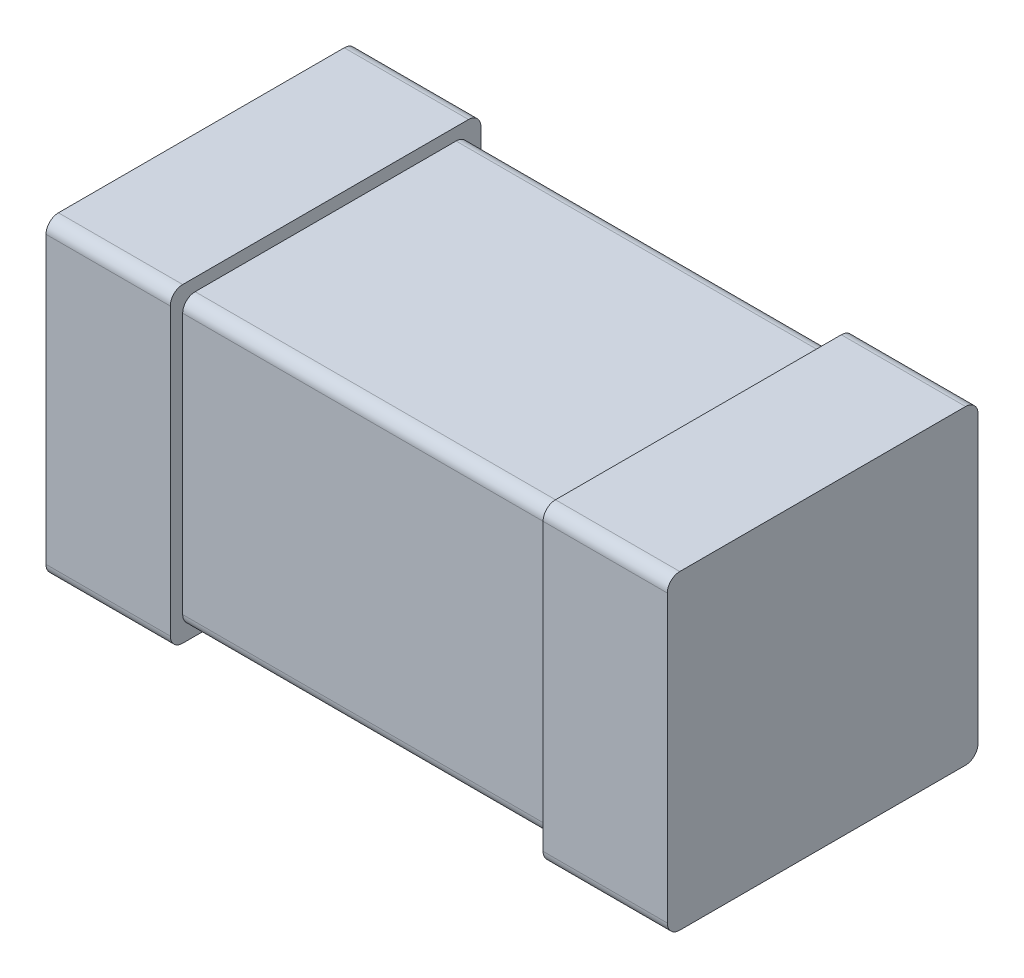
ISO-10303-21;
HEADER;
FILE_DESCRIPTION(('STEP AP214'),'2;1');
FILE_NAME('part.step','',(''),(''),'','','');
FILE_SCHEMA(('AUTOMOTIVE_DESIGN { 1 0 10303 214 1 1 1 1 }'));
ENDSEC;
DATA;
#1=APPLICATION_CONTEXT('core data for automotive mechanical design processes');
#2=APPLICATION_PROTOCOL_DEFINITION('international standard','automotive_design',2000,#1);
#3=PRODUCT_CONTEXT('',#1,'mechanical');
#4=PRODUCT('Part','Part','',(#3));
#5=PRODUCT_RELATED_PRODUCT_CATEGORY('part','',(#4));
#6=PRODUCT_DEFINITION_FORMATION('','',#4);
#7=PRODUCT_DEFINITION_CONTEXT('part definition',#1,'design');
#8=PRODUCT_DEFINITION('design','',#6,#7);
#9=PRODUCT_DEFINITION_SHAPE('','',#8);
#10=(LENGTH_UNIT() NAMED_UNIT(*) SI_UNIT(.MILLI.,.METRE.));
#11=(NAMED_UNIT(*) PLANE_ANGLE_UNIT() SI_UNIT($,.RADIAN.));
#12=(NAMED_UNIT(*) SI_UNIT($,.STERADIAN.) SOLID_ANGLE_UNIT());
#13=UNCERTAINTY_MEASURE_WITH_UNIT(LENGTH_MEASURE(1.E-05),#10,'distance_accuracy_value','');
#14=(GEOMETRIC_REPRESENTATION_CONTEXT(3) GLOBAL_UNCERTAINTY_ASSIGNED_CONTEXT((#13)) GLOBAL_UNIT_ASSIGNED_CONTEXT((#10,
#11,#12)) REPRESENTATION_CONTEXT('',''));
#15=CARTESIAN_POINT('',(0.,0.,0.));
#16=DIRECTION('',(0.,0.,1.));
#17=DIRECTION('',(1.,0.,0.));
#18=AXIS2_PLACEMENT_3D('',#15,#16,#17);
#19=CARTESIAN_POINT('',(-0.5,-0.25,0.));
#20=DIRECTION('',(1.,0.,0.));
#21=DIRECTION('',(0.,0.,-1.));
#22=AXIS2_PLACEMENT_3D('',#19,#20,#21);
#23=PLANE('',#22);
#24=DIRECTION('',(0.,1.,0.));
#25=VECTOR('',#24,1.);
#26=CARTESIAN_POINT('',(-0.5,-0.25,0.5));
#27=LINE('',#26,#25);
#28=CARTESIAN_POINT('',(-0.5,0.23,0.5));
#29=VERTEX_POINT('',#28);
#30=CARTESIAN_POINT('',(-0.5,-0.23,0.5));
#31=VERTEX_POINT('',#30);
#32=EDGE_CURVE('E300',#29,#31,#27,.F.);
#33=ORIENTED_EDGE('',*,*,#32,.F.);
#34=CARTESIAN_POINT('',(-0.5,0.23,0.48));
#35=DIRECTION('',(1.,0.,0.));
#36=DIRECTION('',(0.,0.,-1.));
#37=AXIS2_PLACEMENT_3D('',#34,#35,#36);
#38=CIRCLE('',#37,0.02);
#39=CARTESIAN_POINT('',(-0.5,0.25,0.48));
#40=VERTEX_POINT('',#39);
#41=EDGE_CURVE('E279',#40,#29,#38,.T.);
#42=ORIENTED_EDGE('',*,*,#41,.F.);
#43=DIRECTION('',(0.,0.,1.));
#44=VECTOR('',#43,1.);
#45=CARTESIAN_POINT('',(-0.5,0.25,0.));
#46=LINE('',#45,#44);
#47=CARTESIAN_POINT('',(-0.5,0.25,0.02));
#48=VERTEX_POINT('',#47);
#49=EDGE_CURVE('E201',#48,#40,#46,.T.);
#50=ORIENTED_EDGE('',*,*,#49,.F.);
#51=CARTESIAN_POINT('',(-0.5,0.23,0.02));
#52=DIRECTION('',(1.,0.,0.));
#53=DIRECTION('',(0.,0.,-1.));
#54=AXIS2_PLACEMENT_3D('',#51,#52,#53);
#55=CIRCLE('',#54,0.02);
#56=CARTESIAN_POINT('',(-0.5,0.23,0.));
#57=VERTEX_POINT('',#56);
#58=EDGE_CURVE('E196',#57,#48,#55,.T.);
#59=ORIENTED_EDGE('',*,*,#58,.F.);
#60=DIRECTION('',(0.,1.,0.));
#61=VECTOR('',#60,1.);
#62=CARTESIAN_POINT('',(-0.5,-0.25,0.));
#63=LINE('',#62,#61);
#64=CARTESIAN_POINT('',(-0.5,-0.23,0.));
#65=VERTEX_POINT('',#64);
#66=EDGE_CURVE('E188',#57,#65,#63,.F.);
#67=ORIENTED_EDGE('',*,*,#66,.T.);
#68=CARTESIAN_POINT('',(-0.5,-0.23,0.02));
#69=DIRECTION('',(1.,0.,0.));
#70=DIRECTION('',(0.,0.,-1.));
#71=AXIS2_PLACEMENT_3D('',#68,#69,#70);
#72=CIRCLE('',#71,0.02);
#73=CARTESIAN_POINT('',(-0.5,-0.25,0.02));
#74=VERTEX_POINT('',#73);
#75=EDGE_CURVE('E20',#74,#65,#72,.T.);
#76=ORIENTED_EDGE('',*,*,#75,.F.);
#77=DIRECTION('',(0.,0.,1.));
#78=VECTOR('',#77,1.);
#79=CARTESIAN_POINT('',(-0.5,-0.25,0.));
#80=LINE('',#79,#78);
#81=CARTESIAN_POINT('',(-0.5,-0.25,0.48));
#82=VERTEX_POINT('',#81);
#83=EDGE_CURVE('E171',#74,#82,#80,.T.);
#84=ORIENTED_EDGE('',*,*,#83,.T.);
#85=CARTESIAN_POINT('',(-0.5,-0.23,0.48));
#86=DIRECTION('',(1.,0.,0.));
#87=DIRECTION('',(0.,0.,-1.));
#88=AXIS2_PLACEMENT_3D('',#85,#86,#87);
#89=CIRCLE('',#88,0.02);
#90=EDGE_CURVE('E275',#31,#82,#89,.T.);
#91=ORIENTED_EDGE('',*,*,#90,.F.);
#92=EDGE_LOOP('',(#33,#42,#50,#59,#67,#76,#84,#91));
#93=FACE_BOUND('',#92,.T.);
#94=ADVANCED_FACE('F17',(#93),#23,.F.);
#95=CARTESIAN_POINT('',(0.5,-0.25,0.));
#96=DIRECTION('',(1.,0.,0.));
#97=DIRECTION('',(0.,0.,-1.));
#98=AXIS2_PLACEMENT_3D('',#95,#96,#97);
#99=PLANE('',#98);
#100=DIRECTION('',(0.,1.,0.));
#101=VECTOR('',#100,1.);
#102=CARTESIAN_POINT('',(0.5,-0.25,0.5));
#103=LINE('',#102,#101);
#104=CARTESIAN_POINT('',(0.5,-0.23,0.5));
#105=VERTEX_POINT('',#104);
#106=CARTESIAN_POINT('',(0.5,0.23,0.5));
#107=VERTEX_POINT('',#106);
#108=EDGE_CURVE('E290',#105,#107,#103,.T.);
#109=ORIENTED_EDGE('',*,*,#108,.F.);
#110=CARTESIAN_POINT('',(0.5,-0.23,0.48));
#111=DIRECTION('',(1.,0.,0.));
#112=DIRECTION('',(0.,0.,-1.));
#113=AXIS2_PLACEMENT_3D('',#110,#111,#112);
#114=CIRCLE('',#113,0.02);
#115=CARTESIAN_POINT('',(0.5,-0.25,0.48));
#116=VERTEX_POINT('',#115);
#117=EDGE_CURVE('E259',#116,#105,#114,.F.);
#118=ORIENTED_EDGE('',*,*,#117,.F.);
#119=DIRECTION('',(0.,0.,1.));
#120=VECTOR('',#119,1.);
#121=CARTESIAN_POINT('',(0.5,-0.25,0.));
#122=LINE('',#121,#120);
#123=CARTESIAN_POINT('',(0.5,-0.25,0.02));
#124=VERTEX_POINT('',#123);
#125=EDGE_CURVE('E274',#116,#124,#122,.F.);
#126=ORIENTED_EDGE('',*,*,#125,.T.);
#127=CARTESIAN_POINT('',(0.5,-0.23,0.02));
#128=DIRECTION('',(1.,0.,0.));
#129=DIRECTION('',(0.,0.,-1.));
#130=AXIS2_PLACEMENT_3D('',#127,#128,#129);
#131=CIRCLE('',#130,0.02);
#132=CARTESIAN_POINT('',(0.5,-0.23,0.));
#133=VERTEX_POINT('',#132);
#134=EDGE_CURVE('E271',#133,#124,#131,.F.);
#135=ORIENTED_EDGE('',*,*,#134,.F.);
#136=DIRECTION('',(0.,1.,0.));
#137=VECTOR('',#136,1.);
#138=CARTESIAN_POINT('',(0.5,-0.25,0.));
#139=LINE('',#138,#137);
#140=CARTESIAN_POINT('',(0.5,0.23,0.));
#141=VERTEX_POINT('',#140);
#142=EDGE_CURVE('E270',#133,#141,#139,.T.);
#143=ORIENTED_EDGE('',*,*,#142,.T.);
#144=CARTESIAN_POINT('',(0.5,0.23,0.02));
#145=DIRECTION('',(1.,0.,0.));
#146=DIRECTION('',(0.,0.,-1.));
#147=AXIS2_PLACEMENT_3D('',#144,#145,#146);
#148=CIRCLE('',#147,0.02);
#149=CARTESIAN_POINT('',(0.5,0.25,0.02));
#150=VERTEX_POINT('',#149);
#151=EDGE_CURVE('E267',#150,#141,#148,.F.);
#152=ORIENTED_EDGE('',*,*,#151,.F.);
#153=DIRECTION('',(0.,0.,1.));
#154=VECTOR('',#153,1.);
#155=CARTESIAN_POINT('',(0.5,0.25,0.));
#156=LINE('',#155,#154);
#157=CARTESIAN_POINT('',(0.5,0.25,0.48));
#158=VERTEX_POINT('',#157);
#159=EDGE_CURVE('E295',#158,#150,#156,.F.);
#160=ORIENTED_EDGE('',*,*,#159,.F.);
#161=CARTESIAN_POINT('',(0.5,0.23,0.48));
#162=DIRECTION('',(1.,0.,0.));
#163=DIRECTION('',(0.,0.,-1.));
#164=AXIS2_PLACEMENT_3D('',#161,#162,#163);
#165=CIRCLE('',#164,0.02);
#166=EDGE_CURVE('E263',#107,#158,#165,.F.);
#167=ORIENTED_EDGE('',*,*,#166,.F.);
#168=EDGE_LOOP('',(#109,#118,#126,#135,#143,#152,#160,#167));
#169=FACE_BOUND('',#168,.T.);
#170=ADVANCED_FACE('F444',(#169),#99,.T.);
#171=CARTESIAN_POINT('',(-0.5,-0.25,0.));
#172=DIRECTION('',(0.,1.,0.));
#173=DIRECTION('',(0.,0.,1.));
#174=AXIS2_PLACEMENT_3D('',#171,#172,#173);
#175=PLANE('',#174);
#176=ORIENTED_EDGE('',*,*,#83,.F.);
#177=DIRECTION('',(1.,0.,0.));
#178=VECTOR('',#177,1.);
#179=CARTESIAN_POINT('',(-0.5,-0.25,0.02));
#180=LINE('',#179,#178);
#181=CARTESIAN_POINT('',(-0.3,-0.25,0.02));
#182=VERTEX_POINT('',#181);
#183=EDGE_CURVE('E182',#182,#74,#180,.F.);
#184=ORIENTED_EDGE('',*,*,#183,.F.);
#185=DIRECTION('',(0.,0.,-1.));
#186=VECTOR('',#185,1.);
#187=CARTESIAN_POINT('',(-0.3,-0.25,0.));
#188=LINE('',#187,#186);
#189=CARTESIAN_POINT('',(-0.3,-0.25,0.48));
#190=VERTEX_POINT('',#189);
#191=EDGE_CURVE('E258',#190,#182,#188,.T.);
#192=ORIENTED_EDGE('',*,*,#191,.F.);
#193=DIRECTION('',(1.,0.,0.));
#194=VECTOR('',#193,1.);
#195=CARTESIAN_POINT('',(-0.5,-0.25,0.48));
#196=LINE('',#195,#194);
#197=EDGE_CURVE('E307',#82,#190,#196,.T.);
#198=ORIENTED_EDGE('',*,*,#197,.F.);
#199=EDGE_LOOP('',(#176,#184,#192,#198));
#200=FACE_BOUND('',#199,.T.);
#201=ADVANCED_FACE('F310',(#200),#175,.F.);
#202=CARTESIAN_POINT('',(-0.5,-0.23,0.02));
#203=DIRECTION('',(1.,0.,0.));
#204=DIRECTION('',(0.,0.,-1.));
#205=AXIS2_PLACEMENT_3D('',#202,#203,#204);
#206=CYLINDRICAL_SURFACE('',#205,0.02);
#207=CARTESIAN_POINT('',(-0.3,-0.23,0.02));
#208=DIRECTION('',(1.,0.,0.));
#209=DIRECTION('',(0.,0.,-1.));
#210=AXIS2_PLACEMENT_3D('',#207,#208,#209);
#211=CIRCLE('',#210,0.02);
#212=CARTESIAN_POINT('',(-0.3,-0.23,0.));
#213=VERTEX_POINT('',#212);
#214=EDGE_CURVE('E256',#182,#213,#211,.T.);
#215=ORIENTED_EDGE('',*,*,#214,.F.);
#216=ORIENTED_EDGE('',*,*,#183,.T.);
#217=ORIENTED_EDGE('',*,*,#75,.T.);
#218=DIRECTION('',(1.,0.,0.));
#219=VECTOR('',#218,1.);
#220=CARTESIAN_POINT('',(-0.5,-0.23,0.));
#221=LINE('',#220,#219);
#222=EDGE_CURVE('E180',#65,#213,#221,.T.);
#223=ORIENTED_EDGE('',*,*,#222,.T.);
#224=EDGE_LOOP('',(#215,#216,#217,#223));
#225=FACE_BOUND('',#224,.T.);
#226=ADVANCED_FACE('F179',(#225),#206,.T.);
#227=CARTESIAN_POINT('',(-0.5,-0.25,0.));
#228=DIRECTION('',(0.,0.,1.));
#229=DIRECTION('',(1.,0.,0.));
#230=AXIS2_PLACEMENT_3D('',#227,#228,#229);
#231=PLANE('',#230);
#232=DIRECTION('',(0.,1.,0.));
#233=VECTOR('',#232,1.);
#234=CARTESIAN_POINT('',(-0.3,-0.25,0.));
#235=LINE('',#234,#233);
#236=CARTESIAN_POINT('',(-0.3,0.23,0.));
#237=VERTEX_POINT('',#236);
#238=EDGE_CURVE('E190',#213,#237,#235,.T.);
#239=ORIENTED_EDGE('',*,*,#238,.F.);
#240=ORIENTED_EDGE('',*,*,#222,.F.);
#241=ORIENTED_EDGE('',*,*,#66,.F.);
#242=DIRECTION('',(1.,0.,0.));
#243=VECTOR('',#242,1.);
#244=CARTESIAN_POINT('',(-0.5,0.23,0.));
#245=LINE('',#244,#243);
#246=EDGE_CURVE('E191',#237,#57,#245,.F.);
#247=ORIENTED_EDGE('',*,*,#246,.F.);
#248=EDGE_LOOP('',(#239,#240,#241,#247));
#249=FACE_BOUND('',#248,.T.);
#250=ADVANCED_FACE('F186',(#249),#231,.F.);
#251=CARTESIAN_POINT('',(-0.5,0.23,0.02));
#252=DIRECTION('',(1.,0.,0.));
#253=DIRECTION('',(0.,0.,-1.));
#254=AXIS2_PLACEMENT_3D('',#251,#252,#253);
#255=CYLINDRICAL_SURFACE('',#254,0.02);
#256=ORIENTED_EDGE('',*,*,#246,.T.);
#257=ORIENTED_EDGE('',*,*,#58,.T.);
#258=DIRECTION('',(1.,0.,0.));
#259=VECTOR('',#258,1.);
#260=CARTESIAN_POINT('',(-0.5,0.25,0.02));
#261=LINE('',#260,#259);
#262=CARTESIAN_POINT('',(-0.3,0.25,0.02));
#263=VERTEX_POINT('',#262);
#264=EDGE_CURVE('E281',#263,#48,#261,.F.);
#265=ORIENTED_EDGE('',*,*,#264,.F.);
#266=CARTESIAN_POINT('',(-0.3,0.23,0.02));
#267=DIRECTION('',(1.,0.,0.));
#268=DIRECTION('',(0.,0.,-1.));
#269=AXIS2_PLACEMENT_3D('',#266,#267,#268);
#270=CIRCLE('',#269,0.02);
#271=EDGE_CURVE('E254',#237,#263,#270,.T.);
#272=ORIENTED_EDGE('',*,*,#271,.F.);
#273=EDGE_LOOP('',(#256,#257,#265,#272));
#274=FACE_BOUND('',#273,.T.);
#275=ADVANCED_FACE('F674',(#274),#255,.T.);
#276=CARTESIAN_POINT('',(-0.5,0.25,0.));
#277=DIRECTION('',(0.,1.,0.));
#278=DIRECTION('',(0.,0.,1.));
#279=AXIS2_PLACEMENT_3D('',#276,#277,#278);
#280=PLANE('',#279);
#281=ORIENTED_EDGE('',*,*,#49,.T.);
#282=DIRECTION('',(1.,0.,0.));
#283=VECTOR('',#282,1.);
#284=CARTESIAN_POINT('',(-0.5,0.25,0.48));
#285=LINE('',#284,#283);
#286=CARTESIAN_POINT('',(-0.3,0.25,0.48));
#287=VERTEX_POINT('',#286);
#288=EDGE_CURVE('E280',#287,#40,#285,.F.);
#289=ORIENTED_EDGE('',*,*,#288,.F.);
#290=DIRECTION('',(0.,0.,-1.));
#291=VECTOR('',#290,1.);
#292=CARTESIAN_POINT('',(-0.3,0.25,0.));
#293=LINE('',#292,#291);
#294=EDGE_CURVE('E253',#263,#287,#293,.F.);
#295=ORIENTED_EDGE('',*,*,#294,.F.);
#296=ORIENTED_EDGE('',*,*,#264,.T.);
#297=EDGE_LOOP('',(#281,#289,#295,#296));
#298=FACE_BOUND('',#297,.T.);
#299=ADVANCED_FACE('F666',(#298),#280,.T.);
#300=CARTESIAN_POINT('',(-0.5,0.23,0.48));
#301=DIRECTION('',(1.,0.,0.));
#302=DIRECTION('',(0.,0.,-1.));
#303=AXIS2_PLACEMENT_3D('',#300,#301,#302);
#304=CYLINDRICAL_SURFACE('',#303,0.02);
#305=CARTESIAN_POINT('',(-0.3,0.23,0.48));
#306=DIRECTION('',(1.,0.,0.));
#307=DIRECTION('',(0.,0.,-1.));
#308=AXIS2_PLACEMENT_3D('',#305,#306,#307);
#309=CIRCLE('',#308,0.02);
#310=CARTESIAN_POINT('',(-0.3,0.23,0.5));
#311=VERTEX_POINT('',#310);
#312=EDGE_CURVE('E251',#287,#311,#309,.T.);
#313=ORIENTED_EDGE('',*,*,#312,.F.);
#314=ORIENTED_EDGE('',*,*,#288,.T.);
#315=ORIENTED_EDGE('',*,*,#41,.T.);
#316=DIRECTION('',(1.,0.,0.));
#317=VECTOR('',#316,1.);
#318=CARTESIAN_POINT('',(-0.5,0.23,0.5));
#319=LINE('',#318,#317);
#320=EDGE_CURVE('E301',#311,#29,#319,.F.);
#321=ORIENTED_EDGE('',*,*,#320,.F.);
#322=EDGE_LOOP('',(#313,#314,#315,#321));
#323=FACE_BOUND('',#322,.T.);
#324=ADVANCED_FACE('F322',(#323),#304,.T.);
#325=CARTESIAN_POINT('',(-0.5,-0.25,0.5));
#326=DIRECTION('',(0.,0.,1.));
#327=DIRECTION('',(1.,0.,0.));
#328=AXIS2_PLACEMENT_3D('',#325,#326,#327);
#329=PLANE('',#328);
#330=DIRECTION('',(0.,1.,0.));
#331=VECTOR('',#330,1.);
#332=CARTESIAN_POINT('',(-0.3,-0.25,0.5));
#333=LINE('',#332,#331);
#334=CARTESIAN_POINT('',(-0.3,-0.23,0.5));
#335=VERTEX_POINT('',#334);
#336=EDGE_CURVE('E250',#311,#335,#333,.F.);
#337=ORIENTED_EDGE('',*,*,#336,.F.);
#338=ORIENTED_EDGE('',*,*,#320,.T.);
#339=ORIENTED_EDGE('',*,*,#32,.T.);
#340=DIRECTION('',(1.,0.,0.));
#341=VECTOR('',#340,1.);
#342=CARTESIAN_POINT('',(-0.5,-0.23,0.5));
#343=LINE('',#342,#341);
#344=EDGE_CURVE('E278',#335,#31,#343,.F.);
#345=ORIENTED_EDGE('',*,*,#344,.F.);
#346=EDGE_LOOP('',(#337,#338,#339,#345));
#347=FACE_BOUND('',#346,.T.);
#348=ADVANCED_FACE('F328',(#347),#329,.T.);
#349=CARTESIAN_POINT('',(-0.5,-0.23,0.48));
#350=DIRECTION('',(1.,0.,0.));
#351=DIRECTION('',(0.,0.,-1.));
#352=AXIS2_PLACEMENT_3D('',#349,#350,#351);
#353=CYLINDRICAL_SURFACE('',#352,0.02);
#354=ORIENTED_EDGE('',*,*,#344,.T.);
#355=ORIENTED_EDGE('',*,*,#90,.T.);
#356=ORIENTED_EDGE('',*,*,#197,.T.);
#357=CARTESIAN_POINT('',(-0.3,-0.23,0.48));
#358=DIRECTION('',(1.,0.,0.));
#359=DIRECTION('',(0.,0.,-1.));
#360=AXIS2_PLACEMENT_3D('',#357,#358,#359);
#361=CIRCLE('',#360,0.02);
#362=EDGE_CURVE('E247',#335,#190,#361,.T.);
#363=ORIENTED_EDGE('',*,*,#362,.F.);
#364=EDGE_LOOP('',(#354,#355,#356,#363));
#365=FACE_BOUND('',#364,.T.);
#366=ADVANCED_FACE('F305',(#365),#353,.T.);
#367=CARTESIAN_POINT('',(0.3,-0.25,0.));
#368=DIRECTION('',(0.,1.,0.));
#369=DIRECTION('',(0.,0.,1.));
#370=AXIS2_PLACEMENT_3D('',#367,#368,#369);
#371=PLANE('',#370);
#372=DIRECTION('',(0.,0.,-1.));
#373=VECTOR('',#372,1.);
#374=CARTESIAN_POINT('',(0.3,-0.25,0.));
#375=LINE('',#374,#373);
#376=CARTESIAN_POINT('',(0.3,-0.25,0.48));
#377=VERTEX_POINT('',#376);
#378=CARTESIAN_POINT('',(0.3,-0.25,0.02));
#379=VERTEX_POINT('',#378);
#380=EDGE_CURVE('E236',#377,#379,#375,.T.);
#381=ORIENTED_EDGE('',*,*,#380,.T.);
#382=DIRECTION('',(1.,0.,0.));
#383=VECTOR('',#382,1.);
#384=CARTESIAN_POINT('',(0.3,-0.25,0.02));
#385=LINE('',#384,#383);
#386=EDGE_CURVE('E273',#124,#379,#385,.F.);
#387=ORIENTED_EDGE('',*,*,#386,.F.);
#388=ORIENTED_EDGE('',*,*,#125,.F.);
#389=DIRECTION('',(1.,0.,0.));
#390=VECTOR('',#389,1.);
#391=CARTESIAN_POINT('',(0.3,-0.25,0.48));
#392=LINE('',#391,#390);
#393=EDGE_CURVE('E262',#377,#116,#392,.T.);
#394=ORIENTED_EDGE('',*,*,#393,.F.);
#395=EDGE_LOOP('',(#381,#387,#388,#394));
#396=FACE_BOUND('',#395,.T.);
#397=ADVANCED_FACE('F369',(#396),#371,.F.);
#398=CARTESIAN_POINT('',(0.3,-0.23,0.02));
#399=DIRECTION('',(1.,0.,0.));
#400=DIRECTION('',(0.,0.,-1.));
#401=AXIS2_PLACEMENT_3D('',#398,#399,#400);
#402=CYLINDRICAL_SURFACE('',#401,0.02);
#403=ORIENTED_EDGE('',*,*,#134,.T.);
#404=ORIENTED_EDGE('',*,*,#386,.T.);
#405=CARTESIAN_POINT('',(0.3,-0.23,0.02));
#406=DIRECTION('',(1.,0.,0.));
#407=DIRECTION('',(0.,0.,-1.));
#408=AXIS2_PLACEMENT_3D('',#405,#406,#407);
#409=CIRCLE('',#408,0.02);
#410=CARTESIAN_POINT('',(0.3,-0.23,0.));
#411=VERTEX_POINT('',#410);
#412=EDGE_CURVE('E233',#379,#411,#409,.T.);
#413=ORIENTED_EDGE('',*,*,#412,.T.);
#414=DIRECTION('',(1.,0.,0.));
#415=VECTOR('',#414,1.);
#416=CARTESIAN_POINT('',(0.3,-0.23,0.));
#417=LINE('',#416,#415);
#418=EDGE_CURVE('E299',#411,#133,#417,.T.);
#419=ORIENTED_EDGE('',*,*,#418,.T.);
#420=EDGE_LOOP('',(#403,#404,#413,#419));
#421=FACE_BOUND('',#420,.T.);
#422=ADVANCED_FACE('F358',(#421),#402,.T.);
#423=CARTESIAN_POINT('',(0.3,-0.25,0.));
#424=DIRECTION('',(0.,0.,1.));
#425=DIRECTION('',(1.,0.,0.));
#426=AXIS2_PLACEMENT_3D('',#423,#424,#425);
#427=PLANE('',#426);
#428=ORIENTED_EDGE('',*,*,#142,.F.);
#429=ORIENTED_EDGE('',*,*,#418,.F.);
#430=DIRECTION('',(0.,1.,0.));
#431=VECTOR('',#430,1.);
#432=CARTESIAN_POINT('',(0.3,-0.25,0.));
#433=LINE('',#432,#431);
#434=CARTESIAN_POINT('',(0.3,0.23,0.));
#435=VERTEX_POINT('',#434);
#436=EDGE_CURVE('E232',#411,#435,#433,.T.);
#437=ORIENTED_EDGE('',*,*,#436,.T.);
#438=DIRECTION('',(1.,0.,0.));
#439=VECTOR('',#438,1.);
#440=CARTESIAN_POINT('',(0.3,0.23,0.));
#441=LINE('',#440,#439);
#442=EDGE_CURVE('E269',#141,#435,#441,.F.);
#443=ORIENTED_EDGE('',*,*,#442,.F.);
#444=EDGE_LOOP('',(#428,#429,#437,#443));
#445=FACE_BOUND('',#444,.T.);
#446=ADVANCED_FACE('F441',(#445),#427,.F.);
#447=CARTESIAN_POINT('',(0.3,0.23,0.02));
#448=DIRECTION('',(1.,0.,0.));
#449=DIRECTION('',(0.,0.,-1.));
#450=AXIS2_PLACEMENT_3D('',#447,#448,#449);
#451=CYLINDRICAL_SURFACE('',#450,0.02);
#452=ORIENTED_EDGE('',*,*,#442,.T.);
#453=CARTESIAN_POINT('',(0.3,0.23,0.02));
#454=DIRECTION('',(1.,0.,0.));
#455=DIRECTION('',(0.,0.,-1.));
#456=AXIS2_PLACEMENT_3D('',#453,#454,#455);
#457=CIRCLE('',#456,0.02);
#458=CARTESIAN_POINT('',(0.3,0.25,0.02));
#459=VERTEX_POINT('',#458);
#460=EDGE_CURVE('E229',#435,#459,#457,.T.);
#461=ORIENTED_EDGE('',*,*,#460,.T.);
#462=DIRECTION('',(1.,0.,0.));
#463=VECTOR('',#462,1.);
#464=CARTESIAN_POINT('',(0.3,0.25,0.02));
#465=LINE('',#464,#463);
#466=EDGE_CURVE('E266',#150,#459,#465,.F.);
#467=ORIENTED_EDGE('',*,*,#466,.F.);
#468=ORIENTED_EDGE('',*,*,#151,.T.);
#469=EDGE_LOOP('',(#452,#461,#467,#468));
#470=FACE_BOUND('',#469,.T.);
#471=ADVANCED_FACE('F436',(#470),#451,.T.);
#472=CARTESIAN_POINT('',(0.3,0.25,0.));
#473=DIRECTION('',(0.,1.,0.));
#474=DIRECTION('',(0.,0.,1.));
#475=AXIS2_PLACEMENT_3D('',#472,#473,#474);
#476=PLANE('',#475);
#477=DIRECTION('',(0.,0.,-1.));
#478=VECTOR('',#477,1.);
#479=CARTESIAN_POINT('',(0.3,0.25,0.));
#480=LINE('',#479,#478);
#481=CARTESIAN_POINT('',(0.3,0.25,0.48));
#482=VERTEX_POINT('',#481);
#483=EDGE_CURVE('E228',#459,#482,#480,.F.);
#484=ORIENTED_EDGE('',*,*,#483,.T.);
#485=DIRECTION('',(1.,0.,0.));
#486=VECTOR('',#485,1.);
#487=CARTESIAN_POINT('',(0.3,0.25,0.48));
#488=LINE('',#487,#486);
#489=EDGE_CURVE('E265',#158,#482,#488,.F.);
#490=ORIENTED_EDGE('',*,*,#489,.F.);
#491=ORIENTED_EDGE('',*,*,#159,.T.);
#492=ORIENTED_EDGE('',*,*,#466,.T.);
#493=EDGE_LOOP('',(#484,#490,#491,#492));
#494=FACE_BOUND('',#493,.T.);
#495=ADVANCED_FACE('F432',(#494),#476,.T.);
#496=CARTESIAN_POINT('',(0.3,0.23,0.48));
#497=DIRECTION('',(1.,0.,0.));
#498=DIRECTION('',(0.,0.,-1.));
#499=AXIS2_PLACEMENT_3D('',#496,#497,#498);
#500=CYLINDRICAL_SURFACE('',#499,0.02);
#501=ORIENTED_EDGE('',*,*,#166,.T.);
#502=ORIENTED_EDGE('',*,*,#489,.T.);
#503=CARTESIAN_POINT('',(0.3,0.23,0.48));
#504=DIRECTION('',(1.,0.,0.));
#505=DIRECTION('',(0.,0.,-1.));
#506=AXIS2_PLACEMENT_3D('',#503,#504,#505);
#507=CIRCLE('',#506,0.02);
#508=CARTESIAN_POINT('',(0.3,0.23,0.5));
#509=VERTEX_POINT('',#508);
#510=EDGE_CURVE('E225',#482,#509,#507,.T.);
#511=ORIENTED_EDGE('',*,*,#510,.T.);
#512=DIRECTION('',(1.,0.,0.));
#513=VECTOR('',#512,1.);
#514=CARTESIAN_POINT('',(0.3,0.23,0.5));
#515=LINE('',#514,#513);
#516=EDGE_CURVE('E292',#107,#509,#515,.F.);
#517=ORIENTED_EDGE('',*,*,#516,.F.);
#518=EDGE_LOOP('',(#501,#502,#511,#517));
#519=FACE_BOUND('',#518,.T.);
#520=ADVANCED_FACE('F455',(#519),#500,.T.);
#521=CARTESIAN_POINT('',(0.3,-0.25,0.5));
#522=DIRECTION('',(0.,0.,1.));
#523=DIRECTION('',(1.,0.,0.));
#524=AXIS2_PLACEMENT_3D('',#521,#522,#523);
#525=PLANE('',#524);
#526=ORIENTED_EDGE('',*,*,#108,.T.);
#527=ORIENTED_EDGE('',*,*,#516,.T.);
#528=DIRECTION('',(0.,1.,0.));
#529=VECTOR('',#528,1.);
#530=CARTESIAN_POINT('',(0.3,-0.25,0.5));
#531=LINE('',#530,#529);
#532=CARTESIAN_POINT('',(0.3,-0.23,0.5));
#533=VERTEX_POINT('',#532);
#534=EDGE_CURVE('E224',#509,#533,#531,.F.);
#535=ORIENTED_EDGE('',*,*,#534,.T.);
#536=DIRECTION('',(1.,0.,0.));
#537=VECTOR('',#536,1.);
#538=CARTESIAN_POINT('',(0.3,-0.23,0.5));
#539=LINE('',#538,#537);
#540=EDGE_CURVE('E261',#105,#533,#539,.F.);
#541=ORIENTED_EDGE('',*,*,#540,.F.);
#542=EDGE_LOOP('',(#526,#527,#535,#541));
#543=FACE_BOUND('',#542,.T.);
#544=ADVANCED_FACE('F451',(#543),#525,.T.);
#545=CARTESIAN_POINT('',(0.3,-0.23,0.48));
#546=DIRECTION('',(1.,0.,0.));
#547=DIRECTION('',(0.,0.,-1.));
#548=AXIS2_PLACEMENT_3D('',#545,#546,#547);
#549=CYLINDRICAL_SURFACE('',#548,0.02);
#550=ORIENTED_EDGE('',*,*,#540,.T.);
#551=CARTESIAN_POINT('',(0.3,-0.23,0.48));
#552=DIRECTION('',(1.,0.,0.));
#553=DIRECTION('',(0.,0.,-1.));
#554=AXIS2_PLACEMENT_3D('',#551,#552,#553);
#555=CIRCLE('',#554,0.02);
#556=EDGE_CURVE('E221',#533,#377,#555,.T.);
#557=ORIENTED_EDGE('',*,*,#556,.T.);
#558=ORIENTED_EDGE('',*,*,#393,.T.);
#559=ORIENTED_EDGE('',*,*,#117,.T.);
#560=EDGE_LOOP('',(#550,#557,#558,#559));
#561=FACE_BOUND('',#560,.T.);
#562=ADVANCED_FACE('F448',(#561),#549,.T.);
#563=CARTESIAN_POINT('',(-0.3,-0.23,0.02));
#564=DIRECTION('',(0.,1.,0.));
#565=DIRECTION('',(0.,0.,1.));
#566=AXIS2_PLACEMENT_3D('',#563,#564,#565);
#567=PLANE('',#566);
#568=DIRECTION('',(0.,0.,-1.));
#569=VECTOR('',#568,1.);
#570=CARTESIAN_POINT('',(-0.3,-0.23,0.));
#571=LINE('',#570,#569);
#572=CARTESIAN_POINT('',(-0.3,-0.23,0.04));
#573=VERTEX_POINT('',#572);
#574=CARTESIAN_POINT('',(-0.3,-0.23,0.46));
#575=VERTEX_POINT('',#574);
#576=EDGE_CURVE('E246',#573,#575,#571,.F.);
#577=ORIENTED_EDGE('',*,*,#576,.F.);
#578=DIRECTION('',(1.,0.,0.));
#579=VECTOR('',#578,1.);
#580=CARTESIAN_POINT('',(-0.3,-0.23,0.04));
#581=LINE('',#580,#579);
#582=CARTESIAN_POINT('',(0.3,-0.23,0.04));
#583=VERTEX_POINT('',#582);
#584=EDGE_CURVE('E239',#583,#573,#581,.F.);
#585=ORIENTED_EDGE('',*,*,#584,.F.);
#586=DIRECTION('',(0.,0.,-1.));
#587=VECTOR('',#586,1.);
#588=CARTESIAN_POINT('',(0.3,-0.23,0.));
#589=LINE('',#588,#587);
#590=CARTESIAN_POINT('',(0.3,-0.23,0.46));
#591=VERTEX_POINT('',#590);
#592=EDGE_CURVE('E217',#583,#591,#589,.F.);
#593=ORIENTED_EDGE('',*,*,#592,.T.);
#594=DIRECTION('',(1.,0.,0.));
#595=VECTOR('',#594,1.);
#596=CARTESIAN_POINT('',(-0.3,-0.23,0.46));
#597=LINE('',#596,#595);
#598=EDGE_CURVE('E344',#575,#591,#597,.T.);
#599=ORIENTED_EDGE('',*,*,#598,.F.);
#600=EDGE_LOOP('',(#577,#585,#593,#599));
#601=FACE_BOUND('',#600,.T.);
#602=ADVANCED_FACE('F420',(#601),#567,.F.);
#603=CARTESIAN_POINT('',(-0.3,-0.21,0.46));
#604=DIRECTION('',(1.,0.,0.));
#605=DIRECTION('',(0.,0.,-1.));
#606=AXIS2_PLACEMENT_3D('',#603,#604,#605);
#607=CYLINDRICAL_SURFACE('',#606,0.02);
#608=DIRECTION('',(1.,0.,0.));
#609=VECTOR('',#608,1.);
#610=CARTESIAN_POINT('',(-0.3,-0.21,0.48));
#611=LINE('',#610,#609);
#612=CARTESIAN_POINT('',(-0.3,-0.21,0.48));
#613=VERTEX_POINT('',#612);
#614=CARTESIAN_POINT('',(0.3,-0.21,0.48));
#615=VERTEX_POINT('',#614);
#616=EDGE_CURVE('E342',#613,#615,#611,.T.);
#617=ORIENTED_EDGE('',*,*,#616,.F.);
#618=CARTESIAN_POINT('',(-0.3,-0.21,0.46));
#619=DIRECTION('',(1.,0.,0.));
#620=DIRECTION('',(0.,0.,-1.));
#621=AXIS2_PLACEMENT_3D('',#618,#619,#620);
#622=CIRCLE('',#621,0.02);
#623=EDGE_CURVE('E244',#575,#613,#622,.F.);
#624=ORIENTED_EDGE('',*,*,#623,.F.);
#625=ORIENTED_EDGE('',*,*,#598,.T.);
#626=CARTESIAN_POINT('',(0.3,-0.21,0.46));
#627=DIRECTION('',(1.,0.,0.));
#628=DIRECTION('',(0.,0.,-1.));
#629=AXIS2_PLACEMENT_3D('',#626,#627,#628);
#630=CIRCLE('',#629,0.02);
#631=EDGE_CURVE('E214',#591,#615,#630,.F.);
#632=ORIENTED_EDGE('',*,*,#631,.T.);
#633=EDGE_LOOP('',(#617,#624,#625,#632));
#634=FACE_BOUND('',#633,.T.);
#635=ADVANCED_FACE('F422',(#634),#607,.T.);
#636=CARTESIAN_POINT('',(-0.3,-0.23,0.48));
#637=DIRECTION('',(0.,0.,1.));
#638=DIRECTION('',(1.,0.,0.));
#639=AXIS2_PLACEMENT_3D('',#636,#637,#638);
#640=PLANE('',#639);
#641=DIRECTION('',(0.,1.,0.));
#642=VECTOR('',#641,1.);
#643=CARTESIAN_POINT('',(0.3,-0.25,0.48));
#644=LINE('',#643,#642);
#645=CARTESIAN_POINT('',(0.3,0.21,0.48));
#646=VERTEX_POINT('',#645);
#647=EDGE_CURVE('E213',#615,#646,#644,.T.);
#648=ORIENTED_EDGE('',*,*,#647,.T.);
#649=DIRECTION('',(1.,0.,0.));
#650=VECTOR('',#649,1.);
#651=CARTESIAN_POINT('',(-0.3,0.21,0.48));
#652=LINE('',#651,#650);
#653=CARTESIAN_POINT('',(-0.3,0.21,0.48));
#654=VERTEX_POINT('',#653);
#655=EDGE_CURVE('E340',#654,#646,#652,.T.);
#656=ORIENTED_EDGE('',*,*,#655,.F.);
#657=DIRECTION('',(0.,1.,0.));
#658=VECTOR('',#657,1.);
#659=CARTESIAN_POINT('',(-0.3,-0.25,0.48));
#660=LINE('',#659,#658);
#661=EDGE_CURVE('E243',#613,#654,#660,.T.);
#662=ORIENTED_EDGE('',*,*,#661,.F.);
#663=ORIENTED_EDGE('',*,*,#616,.T.);
#664=EDGE_LOOP('',(#648,#656,#662,#663));
#665=FACE_BOUND('',#664,.T.);
#666=ADVANCED_FACE('F393',(#665),#640,.T.);
#667=CARTESIAN_POINT('',(-0.3,0.21,0.46));
#668=DIRECTION('',(1.,0.,0.));
#669=DIRECTION('',(0.,0.,-1.));
#670=AXIS2_PLACEMENT_3D('',#667,#668,#669);
#671=CYLINDRICAL_SURFACE('',#670,0.02);
#672=CARTESIAN_POINT('',(0.3,0.21,0.46));
#673=DIRECTION('',(1.,0.,0.));
#674=DIRECTION('',(0.,0.,-1.));
#675=AXIS2_PLACEMENT_3D('',#672,#673,#674);
#676=CIRCLE('',#675,0.02);
#677=CARTESIAN_POINT('',(0.3,0.23,0.46));
#678=VERTEX_POINT('',#677);
#679=EDGE_CURVE('E209',#646,#678,#676,.F.);
#680=ORIENTED_EDGE('',*,*,#679,.T.);
#681=DIRECTION('',(1.,0.,0.));
#682=VECTOR('',#681,1.);
#683=CARTESIAN_POINT('',(-0.3,0.23,0.46));
#684=LINE('',#683,#682);
#685=CARTESIAN_POINT('',(-0.3,0.23,0.46));
#686=VERTEX_POINT('',#685);
#687=EDGE_CURVE('E337',#686,#678,#684,.T.);
#688=ORIENTED_EDGE('',*,*,#687,.F.);
#689=CARTESIAN_POINT('',(-0.3,0.21,0.46));
#690=DIRECTION('',(1.,0.,0.));
#691=DIRECTION('',(0.,0.,-1.));
#692=AXIS2_PLACEMENT_3D('',#689,#690,#691);
#693=CIRCLE('',#692,0.02);
#694=EDGE_CURVE('E241',#654,#686,#693,.F.);
#695=ORIENTED_EDGE('',*,*,#694,.F.);
#696=ORIENTED_EDGE('',*,*,#655,.T.);
#697=EDGE_LOOP('',(#680,#688,#695,#696));
#698=FACE_BOUND('',#697,.T.);
#699=ADVANCED_FACE('F397',(#698),#671,.T.);
#700=CARTESIAN_POINT('',(-0.3,0.23,0.02));
#701=DIRECTION('',(0.,1.,0.));
#702=DIRECTION('',(0.,0.,1.));
#703=AXIS2_PLACEMENT_3D('',#700,#701,#702);
#704=PLANE('',#703);
#705=DIRECTION('',(0.,0.,-1.));
#706=VECTOR('',#705,1.);
#707=CARTESIAN_POINT('',(-0.3,0.23,0.));
#708=LINE('',#707,#706);
#709=CARTESIAN_POINT('',(-0.3,0.23,0.04));
#710=VERTEX_POINT('',#709);
#711=EDGE_CURVE('E240',#686,#710,#708,.T.);
#712=ORIENTED_EDGE('',*,*,#711,.F.);
#713=ORIENTED_EDGE('',*,*,#687,.T.);
#714=DIRECTION('',(0.,0.,-1.));
#715=VECTOR('',#714,1.);
#716=CARTESIAN_POINT('',(0.3,0.23,0.));
#717=LINE('',#716,#715);
#718=CARTESIAN_POINT('',(0.3,0.23,0.04));
#719=VERTEX_POINT('',#718);
#720=EDGE_CURVE('E212',#678,#719,#717,.T.);
#721=ORIENTED_EDGE('',*,*,#720,.T.);
#722=DIRECTION('',(1.,0.,0.));
#723=VECTOR('',#722,1.);
#724=CARTESIAN_POINT('',(-0.3,0.23,0.04));
#725=LINE('',#724,#723);
#726=EDGE_CURVE('E208',#710,#719,#725,.T.);
#727=ORIENTED_EDGE('',*,*,#726,.F.);
#728=EDGE_LOOP('',(#712,#713,#721,#727));
#729=FACE_BOUND('',#728,.T.);
#730=ADVANCED_FACE('F403',(#729),#704,.T.);
#731=CARTESIAN_POINT('',(-0.3,-0.25,0.));
#732=DIRECTION('',(1.,0.,0.));
#733=DIRECTION('',(0.,0.,-1.));
#734=AXIS2_PLACEMENT_3D('',#731,#732,#733);
#735=PLANE('',#734);
#736=CARTESIAN_POINT('',(-0.3,0.21,0.04));
#737=DIRECTION('',(1.,0.,0.));
#738=DIRECTION('',(0.,0.,-1.));
#739=AXIS2_PLACEMENT_3D('',#736,#737,#738);
#740=CIRCLE('',#739,0.02);
#741=CARTESIAN_POINT('',(-0.3,0.21,0.02));
#742=VERTEX_POINT('',#741);
#743=EDGE_CURVE('E203',#742,#710,#740,.T.);
#744=ORIENTED_EDGE('',*,*,#743,.F.);
#745=DIRECTION('',(0.,1.,0.));
#746=VECTOR('',#745,1.);
#747=CARTESIAN_POINT('',(-0.3,-0.23,0.02));
#748=LINE('',#747,#746);
#749=CARTESIAN_POINT('',(-0.3,-0.21,0.02));
#750=VERTEX_POINT('',#749);
#751=EDGE_CURVE('E206',#742,#750,#748,.F.);
#752=ORIENTED_EDGE('',*,*,#751,.T.);
#753=CARTESIAN_POINT('',(-0.3,-0.21,0.04));
#754=DIRECTION('',(1.,0.,0.));
#755=DIRECTION('',(0.,0.,-1.));
#756=AXIS2_PLACEMENT_3D('',#753,#754,#755);
#757=CIRCLE('',#756,0.02);
#758=EDGE_CURVE('E237',#573,#750,#757,.T.);
#759=ORIENTED_EDGE('',*,*,#758,.F.);
#760=ORIENTED_EDGE('',*,*,#576,.T.);
#761=ORIENTED_EDGE('',*,*,#623,.T.);
#762=ORIENTED_EDGE('',*,*,#661,.T.);
#763=ORIENTED_EDGE('',*,*,#694,.T.);
#764=ORIENTED_EDGE('',*,*,#711,.T.);
#765=EDGE_LOOP('',(#744,#752,#759,#760,#761,#762,#763,#764));
#766=FACE_BOUND('',#765,.T.);
#767=ORIENTED_EDGE('',*,*,#336,.T.);
#768=ORIENTED_EDGE('',*,*,#362,.T.);
#769=ORIENTED_EDGE('',*,*,#191,.T.);
#770=ORIENTED_EDGE('',*,*,#214,.T.);
#771=ORIENTED_EDGE('',*,*,#238,.T.);
#772=ORIENTED_EDGE('',*,*,#271,.T.);
#773=ORIENTED_EDGE('',*,*,#294,.T.);
#774=ORIENTED_EDGE('',*,*,#312,.T.);
#775=EDGE_LOOP('',(#767,#768,#769,#770,#771,#772,#773,#774));
#776=FACE_BOUND('',#775,.T.);
#777=ADVANCED_FACE('F386',(#766,#776),#735,.T.);
#778=CARTESIAN_POINT('',(-0.3,-0.21,0.04));
#779=DIRECTION('',(1.,0.,0.));
#780=DIRECTION('',(0.,0.,-1.));
#781=AXIS2_PLACEMENT_3D('',#778,#779,#780);
#782=CYLINDRICAL_SURFACE('',#781,0.02);
#783=CARTESIAN_POINT('',(0.3,-0.21,0.04));
#784=DIRECTION('',(1.,0.,0.));
#785=DIRECTION('',(0.,0.,-1.));
#786=AXIS2_PLACEMENT_3D('',#783,#784,#785);
#787=CIRCLE('',#786,0.02);
#788=CARTESIAN_POINT('',(0.3,-0.21,0.02));
#789=VERTEX_POINT('',#788);
#790=EDGE_CURVE('E218',#789,#583,#787,.F.);
#791=ORIENTED_EDGE('',*,*,#790,.T.);
#792=ORIENTED_EDGE('',*,*,#584,.T.);
#793=ORIENTED_EDGE('',*,*,#758,.T.);
#794=DIRECTION('',(1.,0.,0.));
#795=VECTOR('',#794,1.);
#796=CARTESIAN_POINT('',(-0.3,-0.21,0.02));
#797=LINE('',#796,#795);
#798=EDGE_CURVE('E374',#750,#789,#797,.T.);
#799=ORIENTED_EDGE('',*,*,#798,.T.);
#800=EDGE_LOOP('',(#791,#792,#793,#799));
#801=FACE_BOUND('',#800,.T.);
#802=ADVANCED_FACE('F416',(#801),#782,.T.);
#803=CARTESIAN_POINT('',(0.3,-0.25,0.));
#804=DIRECTION('',(1.,0.,0.));
#805=DIRECTION('',(0.,0.,-1.));
#806=AXIS2_PLACEMENT_3D('',#803,#804,#805);
#807=PLANE('',#806);
#808=CARTESIAN_POINT('',(0.3,0.21,0.04));
#809=DIRECTION('',(1.,0.,0.));
#810=DIRECTION('',(0.,0.,-1.));
#811=AXIS2_PLACEMENT_3D('',#808,#809,#810);
#812=CIRCLE('',#811,0.02);
#813=CARTESIAN_POINT('',(0.3,0.21,0.02));
#814=VERTEX_POINT('',#813);
#815=EDGE_CURVE('E34',#719,#814,#812,.F.);
#816=ORIENTED_EDGE('',*,*,#815,.F.);
#817=ORIENTED_EDGE('',*,*,#720,.F.);
#818=ORIENTED_EDGE('',*,*,#679,.F.);
#819=ORIENTED_EDGE('',*,*,#647,.F.);
#820=ORIENTED_EDGE('',*,*,#631,.F.);
#821=ORIENTED_EDGE('',*,*,#592,.F.);
#822=ORIENTED_EDGE('',*,*,#790,.F.);
#823=DIRECTION('',(0.,1.,0.));
#824=VECTOR('',#823,1.);
#825=CARTESIAN_POINT('',(0.3,-0.23,0.02));
#826=LINE('',#825,#824);
#827=EDGE_CURVE('E26',#789,#814,#826,.T.);
#828=ORIENTED_EDGE('',*,*,#827,.T.);
#829=EDGE_LOOP('',(#816,#817,#818,#819,#820,#821,#822,#828));
#830=FACE_BOUND('',#829,.T.);
#831=ORIENTED_EDGE('',*,*,#534,.F.);
#832=ORIENTED_EDGE('',*,*,#510,.F.);
#833=ORIENTED_EDGE('',*,*,#483,.F.);
#834=ORIENTED_EDGE('',*,*,#460,.F.);
#835=ORIENTED_EDGE('',*,*,#436,.F.);
#836=ORIENTED_EDGE('',*,*,#412,.F.);
#837=ORIENTED_EDGE('',*,*,#380,.F.);
#838=ORIENTED_EDGE('',*,*,#556,.F.);
#839=EDGE_LOOP('',(#831,#832,#833,#834,#835,#836,#837,#838));
#840=FACE_BOUND('',#839,.T.);
#841=ADVANCED_FACE('F364',(#830,#840),#807,.F.);
#842=CARTESIAN_POINT('',(-0.3,0.21,0.04));
#843=DIRECTION('',(1.,0.,0.));
#844=DIRECTION('',(0.,0.,-1.));
#845=AXIS2_PLACEMENT_3D('',#842,#843,#844);
#846=CYLINDRICAL_SURFACE('',#845,0.02);
#847=DIRECTION('',(1.,0.,0.));
#848=VECTOR('',#847,1.);
#849=CARTESIAN_POINT('',(-0.3,0.21,0.02));
#850=LINE('',#849,#848);
#851=EDGE_CURVE('E11',#814,#742,#850,.F.);
#852=ORIENTED_EDGE('',*,*,#851,.T.);
#853=ORIENTED_EDGE('',*,*,#743,.T.);
#854=ORIENTED_EDGE('',*,*,#726,.T.);
#855=ORIENTED_EDGE('',*,*,#815,.T.);
#856=EDGE_LOOP('',(#852,#853,#854,#855));
#857=FACE_BOUND('',#856,.T.);
#858=ADVANCED_FACE('F404',(#857),#846,.T.);
#859=CARTESIAN_POINT('',(-0.3,-0.23,0.02));
#860=DIRECTION('',(0.,0.,1.));
#861=DIRECTION('',(1.,0.,0.));
#862=AXIS2_PLACEMENT_3D('',#859,#860,#861);
#863=PLANE('',#862);
#864=ORIENTED_EDGE('',*,*,#827,.F.);
#865=ORIENTED_EDGE('',*,*,#798,.F.);
#866=ORIENTED_EDGE('',*,*,#751,.F.);
#867=ORIENTED_EDGE('',*,*,#851,.F.);
#868=EDGE_LOOP('',(#864,#865,#866,#867));
#869=FACE_BOUND('',#868,.T.);
#870=ADVANCED_FACE('F409',(#869),#863,.F.);
#871=CLOSED_SHELL('',(#94,#170,#201,#226,#250,#275,#299,#324,#348,#366,#397,#422,#446,#471,#495,
#520,#544,#562,#602,#635,#666,#699,#730,#777,#802,#841,#858,#870));
#872=MANIFOLD_SOLID_BREP('B1',#871);
#873=ADVANCED_BREP_SHAPE_REPRESENTATION('',(#18,#872),#14);
#874=SHAPE_DEFINITION_REPRESENTATION(#9,#873);
ENDSEC;
END-ISO-10303-21;
